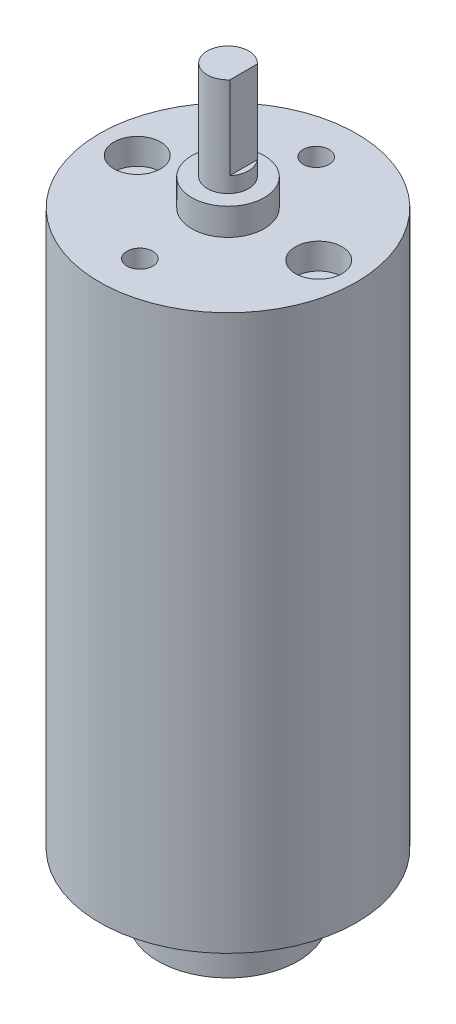
ISO-10303-21;
HEADER;
FILE_DESCRIPTION(('STEP AP214'),'2;1');
FILE_NAME('part.step','',(''),(''),'','','');
FILE_SCHEMA(('AUTOMOTIVE_DESIGN { 1 0 10303 214 1 1 1 1 }'));
ENDSEC;
DATA;
#1=APPLICATION_CONTEXT('core data for automotive mechanical design processes');
#2=APPLICATION_PROTOCOL_DEFINITION('international standard','automotive_design',2000,#1);
#3=PRODUCT_CONTEXT('',#1,'mechanical');
#4=PRODUCT('Part','Part','',(#3));
#5=PRODUCT_RELATED_PRODUCT_CATEGORY('part','',(#4));
#6=PRODUCT_DEFINITION_FORMATION('','',#4);
#7=PRODUCT_DEFINITION_CONTEXT('part definition',#1,'design');
#8=PRODUCT_DEFINITION('design','',#6,#7);
#9=PRODUCT_DEFINITION_SHAPE('','',#8);
#10=(LENGTH_UNIT() NAMED_UNIT(*) SI_UNIT(.MILLI.,.METRE.));
#11=(NAMED_UNIT(*) PLANE_ANGLE_UNIT() SI_UNIT($,.RADIAN.));
#12=(NAMED_UNIT(*) SI_UNIT($,.STERADIAN.) SOLID_ANGLE_UNIT());
#13=UNCERTAINTY_MEASURE_WITH_UNIT(LENGTH_MEASURE(1.E-05),#10,'distance_accuracy_value','');
#14=(GEOMETRIC_REPRESENTATION_CONTEXT(3) GLOBAL_UNCERTAINTY_ASSIGNED_CONTEXT((#13)) GLOBAL_UNIT_ASSIGNED_CONTEXT((#10,
#11,#12)) REPRESENTATION_CONTEXT('',''));
#15=CARTESIAN_POINT('',(0.,0.,0.));
#16=DIRECTION('',(0.,0.,1.));
#17=DIRECTION('',(1.,0.,0.));
#18=AXIS2_PLACEMENT_3D('',#15,#16,#17);
#19=CARTESIAN_POINT('',(0.,0.,0.));
#20=DIRECTION('',(0.,1.,0.));
#21=DIRECTION('',(-1.,0.,0.));
#22=AXIS2_PLACEMENT_3D('',#19,#20,#21);
#23=PLANE('',#22);
#24=CARTESIAN_POINT('',(0.,0.,0.));
#25=DIRECTION('',(0.,-1.,0.));
#26=DIRECTION('',(-1.,0.,0.));
#27=AXIS2_PLACEMENT_3D('',#24,#25,#26);
#28=CIRCLE('',#27,1.);
#29=CARTESIAN_POINT('',(-1.,0.,0.));
#30=VERTEX_POINT('',#29);
#31=EDGE_CURVE('E11',#30,#30,#28,.T.);
#32=ORIENTED_EDGE('',*,*,#31,.T.);
#33=EDGE_LOOP('',(#32));
#34=FACE_BOUND('',#33,.T.);
#35=ADVANCED_FACE('F41',(#34),#23,.F.);
#36=CARTESIAN_POINT('',(0.,73.7,0.));
#37=DIRECTION('',(0.,1.,0.));
#38=DIRECTION('',(-1.,0.,0.));
#39=AXIS2_PLACEMENT_3D('',#36,#37,#38);
#40=CYLINDRICAL_SURFACE('',#39,1.);
#41=CARTESIAN_POINT('',(0.,2.05,0.));
#42=DIRECTION('',(0.,-1.,0.));
#43=DIRECTION('',(-1.,0.,0.));
#44=AXIS2_PLACEMENT_3D('',#41,#42,#43);
#45=CIRCLE('',#44,1.);
#46=CARTESIAN_POINT('',(-1.,2.05,0.));
#47=VERTEX_POINT('',#46);
#48=EDGE_CURVE('E48',#47,#47,#45,.T.);
#49=ORIENTED_EDGE('',*,*,#48,.T.);
#50=EDGE_LOOP('',(#49));
#51=FACE_BOUND('',#50,.T.);
#52=ORIENTED_EDGE('',*,*,#31,.F.);
#53=EDGE_LOOP('',(#52));
#54=FACE_BOUND('',#53,.T.);
#55=ADVANCED_FACE('F119',(#51,#54),#40,.T.);
#56=CARTESIAN_POINT('',(1.,2.05,0.));
#57=DIRECTION('',(0.,1.,0.));
#58=DIRECTION('',(-1.,0.,0.));
#59=AXIS2_PLACEMENT_3D('',#56,#57,#58);
#60=PLANE('',#59);
#61=CARTESIAN_POINT('',(0.,2.05,0.));
#62=DIRECTION('',(0.,-1.,0.));
#63=DIRECTION('',(-1.,0.,0.));
#64=AXIS2_PLACEMENT_3D('',#61,#62,#63);
#65=CIRCLE('',#64,6.75);
#66=CARTESIAN_POINT('',(-6.75,2.05,0.));
#67=VERTEX_POINT('',#66);
#68=EDGE_CURVE('E114',#67,#67,#65,.T.);
#69=ORIENTED_EDGE('',*,*,#68,.T.);
#70=EDGE_LOOP('',(#69));
#71=FACE_BOUND('',#70,.T.);
#72=ORIENTED_EDGE('',*,*,#48,.F.);
#73=EDGE_LOOP('',(#72));
#74=FACE_BOUND('',#73,.T.);
#75=ADVANCED_FACE('F122',(#71,#74),#60,.F.);
#76=CARTESIAN_POINT('',(0.,73.7,0.));
#77=DIRECTION('',(0.,1.,0.));
#78=DIRECTION('',(-1.,0.,0.));
#79=AXIS2_PLACEMENT_3D('',#76,#77,#78);
#80=CYLINDRICAL_SURFACE('',#79,6.75);
#81=CARTESIAN_POINT('',(0.,6.05,0.));
#82=DIRECTION('',(0.,-1.,0.));
#83=DIRECTION('',(-1.,0.,0.));
#84=AXIS2_PLACEMENT_3D('',#81,#82,#83);
#85=CIRCLE('',#84,6.75);
#86=CARTESIAN_POINT('',(-6.75,6.05,0.));
#87=VERTEX_POINT('',#86);
#88=EDGE_CURVE('E111',#87,#87,#85,.T.);
#89=ORIENTED_EDGE('',*,*,#88,.T.);
#90=EDGE_LOOP('',(#89));
#91=FACE_BOUND('',#90,.T.);
#92=ORIENTED_EDGE('',*,*,#68,.F.);
#93=EDGE_LOOP('',(#92));
#94=FACE_BOUND('',#93,.T.);
#95=ADVANCED_FACE('F124',(#91,#94),#80,.T.);
#96=CARTESIAN_POINT('',(6.75,6.05,0.));
#97=DIRECTION('',(0.,-1.,0.));
#98=DIRECTION('',(1.,0.,0.));
#99=AXIS2_PLACEMENT_3D('',#96,#97,#98);
#100=PLANE('',#99);
#101=CARTESIAN_POINT('',(0.,6.05,0.));
#102=DIRECTION('',(0.,-1.,0.));
#103=DIRECTION('',(-1.,0.,0.));
#104=AXIS2_PLACEMENT_3D('',#101,#102,#103);
#105=CIRCLE('',#104,1.);
#106=CARTESIAN_POINT('',(-1.,6.05,0.));
#107=VERTEX_POINT('',#106);
#108=EDGE_CURVE('E108',#107,#107,#105,.T.);
#109=ORIENTED_EDGE('',*,*,#108,.T.);
#110=EDGE_LOOP('',(#109));
#111=FACE_BOUND('',#110,.T.);
#112=ORIENTED_EDGE('',*,*,#88,.F.);
#113=EDGE_LOOP('',(#112));
#114=FACE_BOUND('',#113,.T.);
#115=ADVANCED_FACE('F131',(#111,#114),#100,.F.);
#116=CARTESIAN_POINT('',(0.,73.7,0.));
#117=DIRECTION('',(0.,1.,0.));
#118=DIRECTION('',(-1.,0.,0.));
#119=AXIS2_PLACEMENT_3D('',#116,#117,#118);
#120=CYLINDRICAL_SURFACE('',#119,1.);
#121=CARTESIAN_POINT('',(0.,8.1,0.));
#122=DIRECTION('',(0.,-1.,0.));
#123=DIRECTION('',(-1.,0.,0.));
#124=AXIS2_PLACEMENT_3D('',#121,#122,#123);
#125=CIRCLE('',#124,1.);
#126=CARTESIAN_POINT('',(-1.,8.1,0.));
#127=VERTEX_POINT('',#126);
#128=EDGE_CURVE('E105',#127,#127,#125,.T.);
#129=ORIENTED_EDGE('',*,*,#128,.T.);
#130=EDGE_LOOP('',(#129));
#131=FACE_BOUND('',#130,.T.);
#132=ORIENTED_EDGE('',*,*,#108,.F.);
#133=EDGE_LOOP('',(#132));
#134=FACE_BOUND('',#133,.T.);
#135=ADVANCED_FACE('F173',(#131,#134),#120,.T.);
#136=CARTESIAN_POINT('',(1.,8.1,0.));
#137=DIRECTION('',(0.,1.,0.));
#138=DIRECTION('',(-1.,0.,0.));
#139=AXIS2_PLACEMENT_3D('',#136,#137,#138);
#140=PLANE('',#139);
#141=CARTESIAN_POINT('',(0.,8.1,0.));
#142=DIRECTION('',(0.,-1.,0.));
#143=DIRECTION('',(-1.,0.,0.));
#144=AXIS2_PLACEMENT_3D('',#141,#142,#143);
#145=CIRCLE('',#144,12.4);
#146=CARTESIAN_POINT('',(-12.4,8.09999999999999,0.));
#147=VERTEX_POINT('',#146);
#148=EDGE_CURVE('E102',#147,#147,#145,.T.);
#149=ORIENTED_EDGE('',*,*,#148,.T.);
#150=EDGE_LOOP('',(#149));
#151=FACE_BOUND('',#150,.T.);
#152=ORIENTED_EDGE('',*,*,#128,.F.);
#153=EDGE_LOOP('',(#152));
#154=FACE_BOUND('',#153,.T.);
#155=ADVANCED_FACE('F182',(#151,#154),#140,.F.);
#156=CARTESIAN_POINT('',(0.,73.7,0.));
#157=DIRECTION('',(0.,1.,0.));
#158=DIRECTION('',(-1.,0.,0.));
#159=AXIS2_PLACEMENT_3D('',#156,#157,#158);
#160=CYLINDRICAL_SURFACE('',#159,12.4);
#161=CARTESIAN_POINT('',(0.,61.6,0.));
#162=DIRECTION('',(0.,-1.,0.));
#163=DIRECTION('',(-1.,0.,0.));
#164=AXIS2_PLACEMENT_3D('',#161,#162,#163);
#165=CIRCLE('',#164,12.4);
#166=CARTESIAN_POINT('',(-12.4,61.6,0.));
#167=VERTEX_POINT('',#166);
#168=EDGE_CURVE('E99',#167,#167,#165,.T.);
#169=ORIENTED_EDGE('',*,*,#168,.T.);
#170=EDGE_LOOP('',(#169));
#171=FACE_BOUND('',#170,.T.);
#172=ORIENTED_EDGE('',*,*,#148,.F.);
#173=EDGE_LOOP('',(#172));
#174=FACE_BOUND('',#173,.T.);
#175=ADVANCED_FACE('F192',(#171,#174),#160,.T.);
#176=CARTESIAN_POINT('',(12.4,61.6,0.));
#177=DIRECTION('',(0.,-1.,0.));
#178=DIRECTION('',(1.,0.,0.));
#179=AXIS2_PLACEMENT_3D('',#176,#177,#178);
#180=PLANE('',#179);
#181=CARTESIAN_POINT('',(8.75,61.6,0.));
#182=DIRECTION('',(0.,-1.,0.));
#183=DIRECTION('',(-1.,0.,0.));
#184=AXIS2_PLACEMENT_3D('',#181,#182,#183);
#185=CIRCLE('',#184,2.25);
#186=CARTESIAN_POINT('',(6.5,61.6,0.));
#187=VERTEX_POINT('',#186);
#188=EDGE_CURVE('E89',#187,#187,#185,.T.);
#189=ORIENTED_EDGE('',*,*,#188,.T.);
#190=EDGE_LOOP('',(#189));
#191=FACE_BOUND('',#190,.T.);
#192=CARTESIAN_POINT('',(-8.75000000000001,61.6,0.));
#193=DIRECTION('',(0.,-1.,0.));
#194=DIRECTION('',(-1.,0.,0.));
#195=AXIS2_PLACEMENT_3D('',#192,#193,#194);
#196=CIRCLE('',#195,2.25);
#197=CARTESIAN_POINT('',(-11.,61.6,0.));
#198=VERTEX_POINT('',#197);
#199=EDGE_CURVE('E394',#198,#198,#196,.T.);
#200=ORIENTED_EDGE('',*,*,#199,.T.);
#201=EDGE_LOOP('',(#200));
#202=FACE_BOUND('',#201,.T.);
#203=CARTESIAN_POINT('',(0.,61.6,-8.5));
#204=DIRECTION('',(0.,-1.,0.));
#205=DIRECTION('',(-1.,0.,0.));
#206=AXIS2_PLACEMENT_3D('',#203,#204,#205);
#207=CIRCLE('',#206,1.25);
#208=CARTESIAN_POINT('',(-1.25000000000007,61.6,-8.5));
#209=VERTEX_POINT('',#208);
#210=EDGE_CURVE('E400',#209,#209,#207,.T.);
#211=ORIENTED_EDGE('',*,*,#210,.T.);
#212=EDGE_LOOP('',(#211));
#213=FACE_BOUND('',#212,.T.);
#214=CARTESIAN_POINT('',(0.,61.6,8.5));
#215=DIRECTION('',(0.,-1.,0.));
#216=DIRECTION('',(-1.,0.,0.));
#217=AXIS2_PLACEMENT_3D('',#214,#215,#216);
#218=CIRCLE('',#217,1.25);
#219=CARTESIAN_POINT('',(-1.25000000000001,61.6,8.5));
#220=VERTEX_POINT('',#219);
#221=EDGE_CURVE('E405',#220,#220,#218,.T.);
#222=ORIENTED_EDGE('',*,*,#221,.T.);
#223=EDGE_LOOP('',(#222));
#224=FACE_BOUND('',#223,.T.);
#225=CARTESIAN_POINT('',(0.,61.6,0.));
#226=DIRECTION('',(0.,-1.,0.));
#227=DIRECTION('',(-1.,0.,0.));
#228=AXIS2_PLACEMENT_3D('',#225,#226,#227);
#229=CIRCLE('',#228,3.5);
#230=CARTESIAN_POINT('',(-3.50000000000001,61.6,0.));
#231=VERTEX_POINT('',#230);
#232=EDGE_CURVE('E96',#231,#231,#229,.T.);
#233=ORIENTED_EDGE('',*,*,#232,.T.);
#234=EDGE_LOOP('',(#233));
#235=FACE_BOUND('',#234,.T.);
#236=ORIENTED_EDGE('',*,*,#168,.F.);
#237=EDGE_LOOP('',(#236));
#238=FACE_BOUND('',#237,.T.);
#239=ADVANCED_FACE('F202',(#191,#202,#213,#224,#235,#238),#180,.F.);
#240=CARTESIAN_POINT('',(0.,73.7,0.));
#241=DIRECTION('',(0.,1.,0.));
#242=DIRECTION('',(-1.,0.,0.));
#243=AXIS2_PLACEMENT_3D('',#240,#241,#242);
#244=CYLINDRICAL_SURFACE('',#243,3.5);
#245=CARTESIAN_POINT('',(0.,64.2,0.));
#246=DIRECTION('',(0.,-1.,0.));
#247=DIRECTION('',(-1.,0.,0.));
#248=AXIS2_PLACEMENT_3D('',#245,#246,#247);
#249=CIRCLE('',#248,3.5);
#250=CARTESIAN_POINT('',(-3.50000000000001,64.2,0.));
#251=VERTEX_POINT('',#250);
#252=EDGE_CURVE('E86',#251,#251,#249,.T.);
#253=ORIENTED_EDGE('',*,*,#252,.T.);
#254=EDGE_LOOP('',(#253));
#255=FACE_BOUND('',#254,.T.);
#256=ORIENTED_EDGE('',*,*,#232,.F.);
#257=EDGE_LOOP('',(#256));
#258=FACE_BOUND('',#257,.T.);
#259=ADVANCED_FACE('F212',(#255,#258),#244,.T.);
#260=CARTESIAN_POINT('',(3.49999999999999,64.2,0.));
#261=DIRECTION('',(0.,-1.,0.));
#262=DIRECTION('',(1.,0.,0.));
#263=AXIS2_PLACEMENT_3D('',#260,#261,#262);
#264=PLANE('',#263);
#265=CARTESIAN_POINT('',(0.,64.2,0.));
#266=DIRECTION('',(0.,-1.,0.));
#267=DIRECTION('',(-1.,0.,0.));
#268=AXIS2_PLACEMENT_3D('',#265,#266,#267);
#269=CIRCLE('',#268,2.);
#270=CARTESIAN_POINT('',(-2.00000000000001,64.2,0.));
#271=VERTEX_POINT('',#270);
#272=EDGE_CURVE('E82',#271,#271,#269,.T.);
#273=ORIENTED_EDGE('',*,*,#272,.T.);
#274=EDGE_LOOP('',(#273));
#275=FACE_BOUND('',#274,.T.);
#276=ORIENTED_EDGE('',*,*,#252,.F.);
#277=EDGE_LOOP('',(#276));
#278=FACE_BOUND('',#277,.T.);
#279=ADVANCED_FACE('F222',(#275,#278),#264,.F.);
#280=CARTESIAN_POINT('',(0.,73.7,0.));
#281=DIRECTION('',(0.,1.,0.));
#282=DIRECTION('',(-1.,0.,0.));
#283=AXIS2_PLACEMENT_3D('',#280,#281,#282);
#284=CYLINDRICAL_SURFACE('',#283,2.);
#285=CARTESIAN_POINT('',(0.,65.7,0.));
#286=DIRECTION('',(0.,-1.,0.));
#287=DIRECTION('',(0.,0.,-1.));
#288=AXIS2_PLACEMENT_3D('',#285,#286,#287);
#289=CIRCLE('',#288,2.);
#290=CARTESIAN_POINT('',(1.49999999999999,65.7,-1.32287565553229));
#291=VERTEX_POINT('',#290);
#292=CARTESIAN_POINT('',(1.49999999999999,65.7,1.3228756555323));
#293=VERTEX_POINT('',#292);
#294=EDGE_CURVE('E70',#291,#293,#289,.T.);
#295=ORIENTED_EDGE('',*,*,#294,.T.);
#296=DIRECTION('',(0.,1.,0.));
#297=VECTOR('',#296,1.);
#298=CARTESIAN_POINT('',(1.49999999999999,65.7,1.3228756555323));
#299=LINE('',#298,#297);
#300=CARTESIAN_POINT('',(1.49999999999999,73.7,1.3228756555323));
#301=VERTEX_POINT('',#300);
#302=EDGE_CURVE('E78',#293,#301,#299,.T.);
#303=ORIENTED_EDGE('',*,*,#302,.T.);
#304=CARTESIAN_POINT('',(0.,73.7,0.));
#305=DIRECTION('',(0.,-1.,0.));
#306=DIRECTION('',(-1.,0.,0.));
#307=AXIS2_PLACEMENT_3D('',#304,#305,#306);
#308=CIRCLE('',#307,2.);
#309=CARTESIAN_POINT('',(1.49999999999999,73.7,-1.32287565553229));
#310=VERTEX_POINT('',#309);
#311=EDGE_CURVE('E68',#301,#310,#308,.T.);
#312=ORIENTED_EDGE('',*,*,#311,.T.);
#313=DIRECTION('',(0.,1.,0.));
#314=VECTOR('',#313,1.);
#315=CARTESIAN_POINT('',(1.49999999999999,65.7,-1.32287565553229));
#316=LINE('',#315,#314);
#317=EDGE_CURVE('E72',#291,#310,#316,.T.);
#318=ORIENTED_EDGE('',*,*,#317,.F.);
#319=EDGE_LOOP('',(#295,#303,#312,#318));
#320=FACE_BOUND('',#319,.T.);
#321=ORIENTED_EDGE('',*,*,#272,.F.);
#322=EDGE_LOOP('',(#321));
#323=FACE_BOUND('',#322,.T.);
#324=ADVANCED_FACE('F80',(#320,#323),#284,.T.);
#325=CARTESIAN_POINT('',(1.99999999999999,73.7,0.));
#326=DIRECTION('',(0.,-1.,0.));
#327=DIRECTION('',(1.,0.,0.));
#328=AXIS2_PLACEMENT_3D('',#325,#326,#327);
#329=PLANE('',#328);
#330=ORIENTED_EDGE('',*,*,#311,.F.);
#331=DIRECTION('',(0.,0.,-1.));
#332=VECTOR('',#331,1.);
#333=CARTESIAN_POINT('',(1.49999999999999,73.7,0.));
#334=LINE('',#333,#332);
#335=EDGE_CURVE('E55',#301,#310,#334,.T.);
#336=ORIENTED_EDGE('',*,*,#335,.T.);
#337=EDGE_LOOP('',(#330,#336));
#338=FACE_BOUND('',#337,.T.);
#339=ADVANCED_FACE('F66',(#338),#329,.F.);
#340=CARTESIAN_POINT('',(0.,59.1,8.5));
#341=DIRECTION('',(0.,1.,0.));
#342=DIRECTION('',(-1.,0.,0.));
#343=AXIS2_PLACEMENT_3D('',#340,#341,#342);
#344=CYLINDRICAL_SURFACE('',#343,1.25);
#345=CARTESIAN_POINT('',(0.,59.1,8.5));
#346=DIRECTION('',(0.,-1.,0.));
#347=DIRECTION('',(-1.,0.,0.));
#348=AXIS2_PLACEMENT_3D('',#345,#346,#347);
#349=CIRCLE('',#348,1.25);
#350=CARTESIAN_POINT('',(-1.25000000000001,59.1,8.5));
#351=VERTEX_POINT('',#350);
#352=EDGE_CURVE('E77',#351,#351,#349,.T.);
#353=ORIENTED_EDGE('',*,*,#352,.T.);
#354=EDGE_LOOP('',(#353));
#355=FACE_BOUND('',#354,.T.);
#356=ORIENTED_EDGE('',*,*,#221,.F.);
#357=EDGE_LOOP('',(#356));
#358=FACE_BOUND('',#357,.T.);
#359=ADVANCED_FACE('F249',(#355,#358),#344,.F.);
#360=CARTESIAN_POINT('',(0.,59.1,8.5));
#361=DIRECTION('',(0.,1.,0.));
#362=DIRECTION('',(-1.,0.,0.));
#363=AXIS2_PLACEMENT_3D('',#360,#361,#362);
#364=PLANE('',#363);
#365=ORIENTED_EDGE('',*,*,#352,.F.);
#366=EDGE_LOOP('',(#365));
#367=FACE_BOUND('',#366,.T.);
#368=ADVANCED_FACE('F258',(#367),#364,.T.);
#369=CARTESIAN_POINT('',(0.,59.1,-8.5));
#370=DIRECTION('',(0.,1.,0.));
#371=DIRECTION('',(-1.,0.,0.));
#372=AXIS2_PLACEMENT_3D('',#369,#370,#371);
#373=CYLINDRICAL_SURFACE('',#372,1.25);
#374=CARTESIAN_POINT('',(0.,59.1,-8.5));
#375=DIRECTION('',(0.,-1.,0.));
#376=DIRECTION('',(-1.,0.,0.));
#377=AXIS2_PLACEMENT_3D('',#374,#375,#376);
#378=CIRCLE('',#377,1.25);
#379=CARTESIAN_POINT('',(-1.25000000000007,59.1,-8.5));
#380=VERTEX_POINT('',#379);
#381=EDGE_CURVE('E403',#380,#380,#378,.T.);
#382=ORIENTED_EDGE('',*,*,#381,.T.);
#383=EDGE_LOOP('',(#382));
#384=FACE_BOUND('',#383,.T.);
#385=ORIENTED_EDGE('',*,*,#210,.F.);
#386=EDGE_LOOP('',(#385));
#387=FACE_BOUND('',#386,.T.);
#388=ADVANCED_FACE('F268',(#384,#387),#373,.F.);
#389=CARTESIAN_POINT('',(0.,59.1,-8.5));
#390=DIRECTION('',(0.,1.,0.));
#391=DIRECTION('',(-1.,0.,0.));
#392=AXIS2_PLACEMENT_3D('',#389,#390,#391);
#393=PLANE('',#392);
#394=ORIENTED_EDGE('',*,*,#381,.F.);
#395=EDGE_LOOP('',(#394));
#396=FACE_BOUND('',#395,.T.);
#397=ADVANCED_FACE('F278',(#396),#393,.T.);
#398=CARTESIAN_POINT('',(-8.75000000000001,59.1,0.));
#399=DIRECTION('',(0.,1.,0.));
#400=DIRECTION('',(-1.,0.,0.));
#401=AXIS2_PLACEMENT_3D('',#398,#399,#400);
#402=CYLINDRICAL_SURFACE('',#401,2.25);
#403=CARTESIAN_POINT('',(-8.75000000000001,59.1,0.));
#404=DIRECTION('',(0.,-1.,0.));
#405=DIRECTION('',(-1.,0.,0.));
#406=AXIS2_PLACEMENT_3D('',#403,#404,#405);
#407=CIRCLE('',#406,2.25);
#408=CARTESIAN_POINT('',(-11.,59.1,0.));
#409=VERTEX_POINT('',#408);
#410=EDGE_CURVE('E397',#409,#409,#407,.T.);
#411=ORIENTED_EDGE('',*,*,#410,.T.);
#412=EDGE_LOOP('',(#411));
#413=FACE_BOUND('',#412,.T.);
#414=ORIENTED_EDGE('',*,*,#199,.F.);
#415=EDGE_LOOP('',(#414));
#416=FACE_BOUND('',#415,.T.);
#417=ADVANCED_FACE('F288',(#413,#416),#402,.F.);
#418=CARTESIAN_POINT('',(-8.75000000000001,59.1,0.));
#419=DIRECTION('',(0.,1.,0.));
#420=DIRECTION('',(-1.,0.,0.));
#421=AXIS2_PLACEMENT_3D('',#418,#419,#420);
#422=PLANE('',#421);
#423=ORIENTED_EDGE('',*,*,#410,.F.);
#424=EDGE_LOOP('',(#423));
#425=FACE_BOUND('',#424,.T.);
#426=ADVANCED_FACE('F298',(#425),#422,.T.);
#427=CARTESIAN_POINT('',(8.75,59.1,0.));
#428=DIRECTION('',(0.,1.,0.));
#429=DIRECTION('',(-1.,0.,0.));
#430=AXIS2_PLACEMENT_3D('',#427,#428,#429);
#431=CYLINDRICAL_SURFACE('',#430,2.25);
#432=CARTESIAN_POINT('',(8.75,59.1,0.));
#433=DIRECTION('',(0.,-1.,0.));
#434=DIRECTION('',(-1.,0.,0.));
#435=AXIS2_PLACEMENT_3D('',#432,#433,#434);
#436=CIRCLE('',#435,2.25);
#437=CARTESIAN_POINT('',(6.5,59.1,0.));
#438=VERTEX_POINT('',#437);
#439=EDGE_CURVE('E83',#438,#438,#436,.T.);
#440=ORIENTED_EDGE('',*,*,#439,.T.);
#441=EDGE_LOOP('',(#440));
#442=FACE_BOUND('',#441,.T.);
#443=ORIENTED_EDGE('',*,*,#188,.F.);
#444=EDGE_LOOP('',(#443));
#445=FACE_BOUND('',#444,.T.);
#446=ADVANCED_FACE('F308',(#442,#445),#431,.F.);
#447=CARTESIAN_POINT('',(8.75,59.1,0.));
#448=DIRECTION('',(0.,1.,0.));
#449=DIRECTION('',(-1.,0.,0.));
#450=AXIS2_PLACEMENT_3D('',#447,#448,#449);
#451=PLANE('',#450);
#452=ORIENTED_EDGE('',*,*,#439,.F.);
#453=EDGE_LOOP('',(#452));
#454=FACE_BOUND('',#453,.T.);
#455=ADVANCED_FACE('F318',(#454),#451,.T.);
#456=CARTESIAN_POINT('',(1.49999999999999,65.7,0.));
#457=DIRECTION('',(-1.,0.,0.));
#458=DIRECTION('',(0.,0.,-1.));
#459=AXIS2_PLACEMENT_3D('',#456,#457,#458);
#460=PLANE('',#459);
#461=ORIENTED_EDGE('',*,*,#335,.F.);
#462=ORIENTED_EDGE('',*,*,#302,.F.);
#463=DIRECTION('',(0.,0.,-1.));
#464=VECTOR('',#463,1.);
#465=CARTESIAN_POINT('',(1.49999999999999,65.7,0.));
#466=LINE('',#465,#464);
#467=EDGE_CURVE('E61',#293,#291,#466,.T.);
#468=ORIENTED_EDGE('',*,*,#467,.T.);
#469=ORIENTED_EDGE('',*,*,#317,.T.);
#470=EDGE_LOOP('',(#461,#462,#468,#469));
#471=FACE_BOUND('',#470,.T.);
#472=ADVANCED_FACE('F73',(#471),#460,.F.);
#473=CARTESIAN_POINT('',(0.,65.7,0.));
#474=DIRECTION('',(0.,1.,0.));
#475=DIRECTION('',(0.,0.,-1.));
#476=AXIS2_PLACEMENT_3D('',#473,#474,#475);
#477=PLANE('',#476);
#478=ORIENTED_EDGE('',*,*,#294,.F.);
#479=ORIENTED_EDGE('',*,*,#467,.F.);
#480=EDGE_LOOP('',(#478,#479));
#481=FACE_BOUND('',#480,.T.);
#482=ADVANCED_FACE('F337',(#481),#477,.T.);
#483=CLOSED_SHELL('',(#35,#55,#75,#95,#115,#135,#155,#175,#239,#259,#279,#324,#339,#359,#368,
#388,#397,#417,#426,#446,#455,#472,#482));
#484=MANIFOLD_SOLID_BREP('B2',#483);
#485=ADVANCED_BREP_SHAPE_REPRESENTATION('',(#18,#484),#14);
#486=SHAPE_DEFINITION_REPRESENTATION(#9,#485);
ENDSEC;
END-ISO-10303-21;
